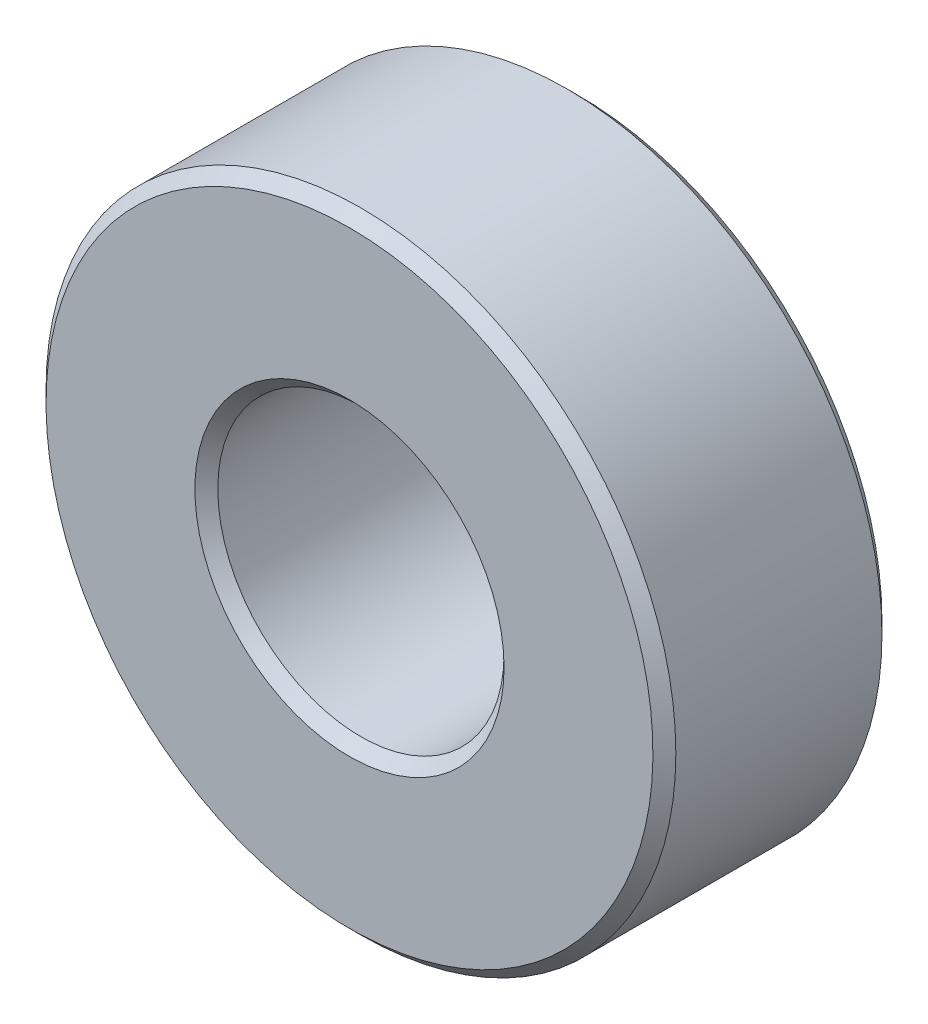
ISO-10303-21;
HEADER;
FILE_DESCRIPTION(('STEP AP214'),'2;1');
FILE_NAME('part.step','',(''),(''),'','','');
FILE_SCHEMA(('AUTOMOTIVE_DESIGN { 1 0 10303 214 1 1 1 1 }'));
ENDSEC;
DATA;
#1=APPLICATION_CONTEXT('core data for automotive mechanical design processes');
#2=APPLICATION_PROTOCOL_DEFINITION('international standard','automotive_design',2000,#1);
#3=PRODUCT_CONTEXT('',#1,'mechanical');
#4=PRODUCT('Part','Part','',(#3));
#5=PRODUCT_RELATED_PRODUCT_CATEGORY('part','',(#4));
#6=PRODUCT_DEFINITION_FORMATION('','',#4);
#7=PRODUCT_DEFINITION_CONTEXT('part definition',#1,'design');
#8=PRODUCT_DEFINITION('design','',#6,#7);
#9=PRODUCT_DEFINITION_SHAPE('','',#8);
#10=(LENGTH_UNIT() NAMED_UNIT(*) SI_UNIT(.MILLI.,.METRE.));
#11=(NAMED_UNIT(*) PLANE_ANGLE_UNIT() SI_UNIT($,.RADIAN.));
#12=(NAMED_UNIT(*) SI_UNIT($,.STERADIAN.) SOLID_ANGLE_UNIT());
#13=UNCERTAINTY_MEASURE_WITH_UNIT(LENGTH_MEASURE(1.E-05),#10,'distance_accuracy_value','');
#14=(GEOMETRIC_REPRESENTATION_CONTEXT(3) GLOBAL_UNCERTAINTY_ASSIGNED_CONTEXT((#13)) GLOBAL_UNIT_ASSIGNED_CONTEXT((#10,
#11,#12)) REPRESENTATION_CONTEXT('',''));
#15=CARTESIAN_POINT('',(0.,0.,0.));
#16=DIRECTION('',(0.,0.,1.));
#17=DIRECTION('',(1.,0.,0.));
#18=AXIS2_PLACEMENT_3D('',#15,#16,#17);
#19=CARTESIAN_POINT('',(0.,0.,4.));
#20=DIRECTION('',(0.,0.,1.));
#21=DIRECTION('',(1.,0.,0.));
#22=AXIS2_PLACEMENT_3D('',#19,#20,#21);
#23=PLANE('',#22);
#24=CARTESIAN_POINT('',(0.,0.,3.99999999996226));
#25=DIRECTION('',(0.,0.,-1.));
#26=DIRECTION('',(0.,1.,0.));
#27=AXIS2_PLACEMENT_3D('',#24,#25,#26);
#28=CIRCLE('',#27,5.29999999997699);
#29=CARTESIAN_POINT('',(0.,5.29999999997699,3.99999999996226));
#30=VERTEX_POINT('',#29);
#31=EDGE_CURVE('E32',#30,#30,#28,.T.);
#32=ORIENTED_EDGE('',*,*,#31,.F.);
#33=EDGE_LOOP('',(#32));
#34=FACE_BOUND('',#33,.T.);
#35=CARTESIAN_POINT('',(0.,0.,4.0000000000191));
#36=DIRECTION('',(0.,0.,1.));
#37=DIRECTION('',(1.,0.,0.));
#38=AXIS2_PLACEMENT_3D('',#35,#36,#37);
#39=CIRCLE('',#38,2.70000000000437);
#40=CARTESIAN_POINT('',(2.70000000000437,0.,4.0000000000191));
#41=VERTEX_POINT('',#40);
#42=EDGE_CURVE('E18',#41,#41,#39,.F.);
#43=ORIENTED_EDGE('',*,*,#42,.T.);
#44=EDGE_LOOP('',(#43));
#45=FACE_BOUND('',#44,.T.);
#46=ADVANCED_FACE('F15',(#34,#45),#23,.T.);
#47=CARTESIAN_POINT('',(0.,0.,4.0000000000191));
#48=DIRECTION('',(0.,0.,1.));
#49=DIRECTION('',(1.,0.,0.));
#50=AXIS2_PLACEMENT_3D('',#47,#48,#49);
#51=CONICAL_SURFACE('',#50,2.70000000000437,0.785398163397448);
#52=ORIENTED_EDGE('',*,*,#42,.F.);
#53=EDGE_LOOP('',(#52));
#54=FACE_BOUND('',#53,.T.);
#55=CARTESIAN_POINT('',(0.,0.,3.8));
#56=DIRECTION('',(0.,0.,-1.));
#57=DIRECTION('',(-1.,0.,0.));
#58=AXIS2_PLACEMENT_3D('',#55,#56,#57);
#59=CIRCLE('',#58,2.5);
#60=CARTESIAN_POINT('',(-2.5,0.,3.8));
#61=VERTEX_POINT('',#60);
#62=EDGE_CURVE('E30',#61,#61,#59,.T.);
#63=ORIENTED_EDGE('',*,*,#62,.T.);
#64=EDGE_LOOP('',(#63));
#65=FACE_BOUND('',#64,.T.);
#66=ADVANCED_FACE('F42',(#54,#65),#51,.F.);
#67=CARTESIAN_POINT('',(0.,0.,3.8000000000693));
#68=DIRECTION('',(0.,0.,-1.));
#69=DIRECTION('',(0.,1.,0.));
#70=AXIS2_PLACEMENT_3D('',#67,#68,#69);
#71=CONICAL_SURFACE('',#70,5.49999999992679,0.785398163539557);
#72=ORIENTED_EDGE('',*,*,#31,.T.);
#73=EDGE_LOOP('',(#72));
#74=FACE_BOUND('',#73,.T.);
#75=CARTESIAN_POINT('',(0.,0.,3.79999999999999));
#76=DIRECTION('',(0.,0.,-1.));
#77=DIRECTION('',(-1.,0.,0.));
#78=AXIS2_PLACEMENT_3D('',#75,#76,#77);
#79=CIRCLE('',#78,5.5);
#80=CARTESIAN_POINT('',(-5.5,0.,3.79999999999999));
#81=VERTEX_POINT('',#80);
#82=EDGE_CURVE('E37',#81,#81,#79,.T.);
#83=ORIENTED_EDGE('',*,*,#82,.F.);
#84=EDGE_LOOP('',(#83));
#85=FACE_BOUND('',#84,.T.);
#86=ADVANCED_FACE('F45',(#74,#85),#71,.T.);
#87=CARTESIAN_POINT('',(0.,0.,4.));
#88=DIRECTION('',(0.,0.,-1.));
#89=DIRECTION('',(-1.,0.,0.));
#90=AXIS2_PLACEMENT_3D('',#87,#88,#89);
#91=CYLINDRICAL_SURFACE('',#90,2.5);
#92=CARTESIAN_POINT('',(0.,0.,0.200000000006639));
#93=DIRECTION('',(0.,0.,-1.));
#94=DIRECTION('',(-1.,0.,0.));
#95=AXIS2_PLACEMENT_3D('',#92,#93,#94);
#96=CIRCLE('',#95,2.49999999994088);
#97=CARTESIAN_POINT('',(-2.49999999994088,0.,0.200000000006639));
#98=VERTEX_POINT('',#97);
#99=EDGE_CURVE('E81',#98,#98,#96,.T.);
#100=ORIENTED_EDGE('',*,*,#99,.T.);
#101=EDGE_LOOP('',(#100));
#102=FACE_BOUND('',#101,.T.);
#103=ORIENTED_EDGE('',*,*,#62,.F.);
#104=EDGE_LOOP('',(#103));
#105=FACE_BOUND('',#104,.T.);
#106=ADVANCED_FACE('F48',(#102,#105),#91,.F.);
#107=CARTESIAN_POINT('',(0.,0.,4.));
#108=DIRECTION('',(0.,0.,-1.));
#109=DIRECTION('',(-1.,0.,0.));
#110=AXIS2_PLACEMENT_3D('',#107,#108,#109);
#111=CYLINDRICAL_SURFACE('',#110,5.5);
#112=ORIENTED_EDGE('',*,*,#82,.T.);
#113=EDGE_LOOP('',(#112));
#114=FACE_BOUND('',#113,.T.);
#115=CARTESIAN_POINT('',(0.,0.,0.200000000006639));
#116=DIRECTION('',(0.,0.,1.));
#117=DIRECTION('',(1.,0.,0.));
#118=AXIS2_PLACEMENT_3D('',#115,#116,#117);
#119=CIRCLE('',#118,5.49999999998363);
#120=CARTESIAN_POINT('',(5.49999999998363,0.,0.200000000006639));
#121=VERTEX_POINT('',#120);
#122=EDGE_CURVE('E27',#121,#121,#119,.F.);
#123=ORIENTED_EDGE('',*,*,#122,.F.);
#124=EDGE_LOOP('',(#123));
#125=FACE_BOUND('',#124,.T.);
#126=ADVANCED_FACE('F50',(#114,#125),#111,.T.);
#127=CARTESIAN_POINT('',(0.,0.,0.));
#128=DIRECTION('',(0.,0.,-1.));
#129=DIRECTION('',(-1.,0.,0.));
#130=AXIS2_PLACEMENT_3D('',#127,#128,#129);
#131=CONICAL_SURFACE('',#130,2.70000000000437,0.785398163539557);
#132=CARTESIAN_POINT('',(0.,0.,0.));
#133=DIRECTION('',(0.,0.,-1.));
#134=DIRECTION('',(-1.,0.,0.));
#135=AXIS2_PLACEMENT_3D('',#132,#133,#134);
#136=CIRCLE('',#135,2.70000000000437);
#137=CARTESIAN_POINT('',(-2.70000000000437,0.,0.));
#138=VERTEX_POINT('',#137);
#139=EDGE_CURVE('E22',#138,#138,#136,.T.);
#140=ORIENTED_EDGE('',*,*,#139,.T.);
#141=EDGE_LOOP('',(#140));
#142=FACE_BOUND('',#141,.T.);
#143=ORIENTED_EDGE('',*,*,#99,.F.);
#144=EDGE_LOOP('',(#143));
#145=FACE_BOUND('',#144,.T.);
#146=ADVANCED_FACE('F58',(#142,#145),#131,.F.);
#147=CARTESIAN_POINT('',(0.,0.,0.200000000006639));
#148=DIRECTION('',(0.,0.,1.));
#149=DIRECTION('',(1.,0.,0.));
#150=AXIS2_PLACEMENT_3D('',#147,#148,#149);
#151=CONICAL_SURFACE('',#150,5.49999999998363,0.78539816325534);
#152=CARTESIAN_POINT('',(0.,0.,-5.6843418860808E-11));
#153=DIRECTION('',(0.,0.,1.));
#154=DIRECTION('',(1.,0.,0.));
#155=AXIS2_PLACEMENT_3D('',#152,#153,#154);
#156=CIRCLE('',#155,5.29999999997699);
#157=CARTESIAN_POINT('',(5.29999999997699,0.,-5.6843418860808E-11));
#158=VERTEX_POINT('',#157);
#159=EDGE_CURVE('E10',#158,#158,#156,.T.);
#160=ORIENTED_EDGE('',*,*,#159,.T.);
#161=EDGE_LOOP('',(#160));
#162=FACE_BOUND('',#161,.T.);
#163=ORIENTED_EDGE('',*,*,#122,.T.);
#164=EDGE_LOOP('',(#163));
#165=FACE_BOUND('',#164,.T.);
#166=ADVANCED_FACE('F65',(#162,#165),#151,.T.);
#167=CARTESIAN_POINT('',(0.,0.,0.));
#168=DIRECTION('',(0.,0.,1.));
#169=DIRECTION('',(1.,0.,0.));
#170=AXIS2_PLACEMENT_3D('',#167,#168,#169);
#171=PLANE('',#170);
#172=ORIENTED_EDGE('',*,*,#159,.F.);
#173=EDGE_LOOP('',(#172));
#174=FACE_BOUND('',#173,.T.);
#175=ORIENTED_EDGE('',*,*,#139,.F.);
#176=EDGE_LOOP('',(#175));
#177=FACE_BOUND('',#176,.T.);
#178=ADVANCED_FACE('F63',(#174,#177),#171,.F.);
#179=CLOSED_SHELL('',(#46,#66,#86,#106,#126,#146,#166,#178));
#180=MANIFOLD_SOLID_BREP('B1',#179);
#181=ADVANCED_BREP_SHAPE_REPRESENTATION('',(#18,#180),#14);
#182=SHAPE_DEFINITION_REPRESENTATION(#9,#181);
ENDSEC;
END-ISO-10303-21;
